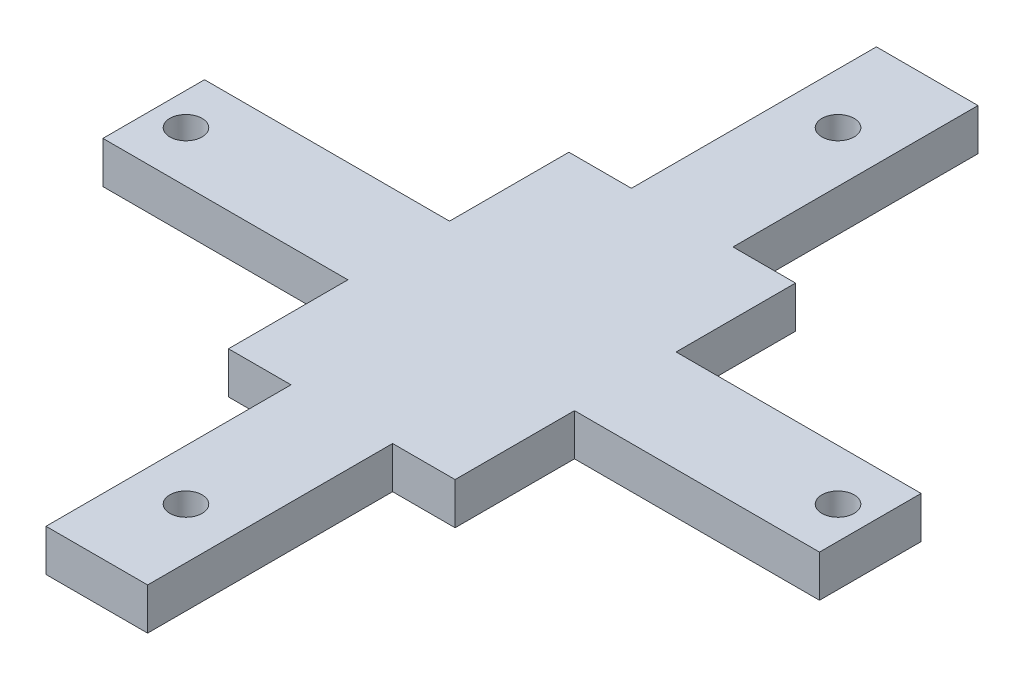
ISO-10303-21;
HEADER;
FILE_DESCRIPTION(('STEP AP214'),'2;1');
FILE_NAME('part.step','',(''),(''),'','','');
FILE_SCHEMA(('AUTOMOTIVE_DESIGN { 1 0 10303 214 1 1 1 1 }'));
ENDSEC;
DATA;
#1=APPLICATION_CONTEXT('core data for automotive mechanical design processes');
#2=APPLICATION_PROTOCOL_DEFINITION('international standard','automotive_design',2000,#1);
#3=PRODUCT_CONTEXT('',#1,'mechanical');
#4=PRODUCT('Part','Part','',(#3));
#5=PRODUCT_RELATED_PRODUCT_CATEGORY('part','',(#4));
#6=PRODUCT_DEFINITION_FORMATION('','',#4);
#7=PRODUCT_DEFINITION_CONTEXT('part definition',#1,'design');
#8=PRODUCT_DEFINITION('design','',#6,#7);
#9=PRODUCT_DEFINITION_SHAPE('','',#8);
#10=(LENGTH_UNIT() NAMED_UNIT(*) SI_UNIT(.MILLI.,.METRE.));
#11=(NAMED_UNIT(*) PLANE_ANGLE_UNIT() SI_UNIT($,.RADIAN.));
#12=(NAMED_UNIT(*) SI_UNIT($,.STERADIAN.) SOLID_ANGLE_UNIT());
#13=UNCERTAINTY_MEASURE_WITH_UNIT(LENGTH_MEASURE(1.E-05),#10,'distance_accuracy_value','');
#14=(GEOMETRIC_REPRESENTATION_CONTEXT(3) GLOBAL_UNCERTAINTY_ASSIGNED_CONTEXT((#13)) GLOBAL_UNIT_ASSIGNED_CONTEXT((#10,
#11,#12)) REPRESENTATION_CONTEXT('',''));
#15=CARTESIAN_POINT('',(0.,0.,0.));
#16=DIRECTION('',(0.,0.,1.));
#17=DIRECTION('',(1.,0.,0.));
#18=AXIS2_PLACEMENT_3D('',#15,#16,#17);
#19=CARTESIAN_POINT('',(11.15,-119.723512511459,16.75));
#20=DIRECTION('',(1.,0.,0.));
#21=DIRECTION('',(0.,1.,0.));
#22=AXIS2_PLACEMENT_3D('',#19,#20,#21);
#23=PLANE('',#22);
#24=DIRECTION('',(0.,0.,1.));
#25=VECTOR('',#24,1.);
#26=CARTESIAN_POINT('',(11.15,-123.833512511459,16.75));
#27=LINE('',#26,#25);
#28=CARTESIAN_POINT('',(11.15,-123.833512511459,5.));
#29=VERTEX_POINT('',#28);
#30=CARTESIAN_POINT('',(11.15,-123.833512511459,16.75));
#31=VERTEX_POINT('',#30);
#32=EDGE_CURVE('E202',#29,#31,#27,.T.);
#33=ORIENTED_EDGE('',*,*,#32,.F.);
#34=DIRECTION('',(0.,-1.,0.));
#35=VECTOR('',#34,1.);
#36=CARTESIAN_POINT('',(11.15,-119.723512511459,5.));
#37=LINE('',#36,#35);
#38=CARTESIAN_POINT('',(11.15,-119.723512511459,5.));
#39=VERTEX_POINT('',#38);
#40=EDGE_CURVE('E11',#39,#29,#37,.T.);
#41=ORIENTED_EDGE('',*,*,#40,.F.);
#42=DIRECTION('',(0.,0.,1.));
#43=VECTOR('',#42,1.);
#44=CARTESIAN_POINT('',(11.15,-119.723512511459,16.75));
#45=LINE('',#44,#43);
#46=CARTESIAN_POINT('',(11.15,-119.723512511459,16.75));
#47=VERTEX_POINT('',#46);
#48=EDGE_CURVE('E259',#39,#47,#45,.T.);
#49=ORIENTED_EDGE('',*,*,#48,.T.);
#50=DIRECTION('',(0.,-1.,0.));
#51=VECTOR('',#50,1.);
#52=CARTESIAN_POINT('',(11.15,-119.723512511459,16.75));
#53=LINE('',#52,#51);
#54=EDGE_CURVE('E36',#47,#31,#53,.T.);
#55=ORIENTED_EDGE('',*,*,#54,.T.);
#56=EDGE_LOOP('',(#33,#41,#49,#55));
#57=FACE_BOUND('',#56,.T.);
#58=ADVANCED_FACE('F33',(#57),#23,.T.);
#59=CARTESIAN_POINT('',(4.99999999999998,-119.723512511459,5.));
#60=DIRECTION('',(0.,0.,-1.));
#61=DIRECTION('',(-1.,0.,0.));
#62=AXIS2_PLACEMENT_3D('',#59,#60,#61);
#63=PLANE('',#62);
#64=DIRECTION('',(1.,0.,0.));
#65=VECTOR('',#64,1.);
#66=CARTESIAN_POINT('',(4.99999999999998,-123.833512511459,5.));
#67=LINE('',#66,#65);
#68=CARTESIAN_POINT('',(4.99999999999998,-123.833512511459,5.));
#69=VERTEX_POINT('',#68);
#70=EDGE_CURVE('E257',#69,#29,#67,.T.);
#71=ORIENTED_EDGE('',*,*,#70,.F.);
#72=DIRECTION('',(0.,-1.,0.));
#73=VECTOR('',#72,1.);
#74=CARTESIAN_POINT('',(4.99999999999998,-119.723512511459,5.));
#75=LINE('',#74,#73);
#76=CARTESIAN_POINT('',(4.99999999999998,-119.723512511459,5.));
#77=VERTEX_POINT('',#76);
#78=EDGE_CURVE('E42',#77,#69,#75,.T.);
#79=ORIENTED_EDGE('',*,*,#78,.F.);
#80=DIRECTION('',(1.,0.,0.));
#81=VECTOR('',#80,1.);
#82=CARTESIAN_POINT('',(4.99999999999998,-119.723512511459,5.));
#83=LINE('',#82,#81);
#84=EDGE_CURVE('E192',#77,#39,#83,.T.);
#85=ORIENTED_EDGE('',*,*,#84,.T.);
#86=ORIENTED_EDGE('',*,*,#40,.T.);
#87=EDGE_LOOP('',(#71,#79,#85,#86));
#88=FACE_BOUND('',#87,.T.);
#89=ADVANCED_FACE('F295',(#88),#63,.T.);
#90=CARTESIAN_POINT('',(4.99999999999998,-119.723512511459,-19.11));
#91=DIRECTION('',(1.,0.,0.));
#92=DIRECTION('',(0.,0.,-1.));
#93=AXIS2_PLACEMENT_3D('',#90,#91,#92);
#94=PLANE('',#93);
#95=DIRECTION('',(0.,0.,1.));
#96=VECTOR('',#95,1.);
#97=CARTESIAN_POINT('',(4.99999999999998,-123.833512511459,-19.11));
#98=LINE('',#97,#96);
#99=CARTESIAN_POINT('',(4.99999999999998,-123.833512511459,-19.11));
#100=VERTEX_POINT('',#99);
#101=EDGE_CURVE('E179',#100,#69,#98,.T.);
#102=ORIENTED_EDGE('',*,*,#101,.F.);
#103=DIRECTION('',(0.,-1.,0.));
#104=VECTOR('',#103,1.);
#105=CARTESIAN_POINT('',(4.99999999999998,-119.723512511459,-19.11));
#106=LINE('',#105,#104);
#107=CARTESIAN_POINT('',(4.99999999999998,-119.723512511459,-19.11));
#108=VERTEX_POINT('',#107);
#109=EDGE_CURVE('E174',#108,#100,#106,.T.);
#110=ORIENTED_EDGE('',*,*,#109,.F.);
#111=DIRECTION('',(0.,0.,1.));
#112=VECTOR('',#111,1.);
#113=CARTESIAN_POINT('',(4.99999999999998,-119.723512511459,-19.11));
#114=LINE('',#113,#112);
#115=EDGE_CURVE('E177',#108,#77,#114,.T.);
#116=ORIENTED_EDGE('',*,*,#115,.T.);
#117=ORIENTED_EDGE('',*,*,#78,.T.);
#118=EDGE_LOOP('',(#102,#110,#116,#117));
#119=FACE_BOUND('',#118,.T.);
#120=ADVANCED_FACE('F176',(#119),#94,.T.);
#121=CARTESIAN_POINT('',(-5.00000000000002,-119.723512511459,-19.11));
#122=DIRECTION('',(0.,0.,-1.));
#123=DIRECTION('',(-1.,0.,0.));
#124=AXIS2_PLACEMENT_3D('',#121,#122,#123);
#125=PLANE('',#124);
#126=DIRECTION('',(1.,0.,0.));
#127=VECTOR('',#126,1.);
#128=CARTESIAN_POINT('',(-5.00000000000002,-123.833512511459,-19.11));
#129=LINE('',#128,#127);
#130=CARTESIAN_POINT('',(-5.00000000000002,-123.833512511459,-19.11));
#131=VERTEX_POINT('',#130);
#132=EDGE_CURVE('E254',#131,#100,#129,.T.);
#133=ORIENTED_EDGE('',*,*,#132,.F.);
#134=DIRECTION('',(0.,-1.,0.));
#135=VECTOR('',#134,1.);
#136=CARTESIAN_POINT('',(-5.00000000000002,-119.723512511459,-19.11));
#137=LINE('',#136,#135);
#138=CARTESIAN_POINT('',(-5.00000000000002,-119.723512511459,-19.11));
#139=VERTEX_POINT('',#138);
#140=EDGE_CURVE('E184',#139,#131,#137,.T.);
#141=ORIENTED_EDGE('',*,*,#140,.F.);
#142=DIRECTION('',(1.,0.,0.));
#143=VECTOR('',#142,1.);
#144=CARTESIAN_POINT('',(-5.00000000000002,-119.723512511459,-19.11));
#145=LINE('',#144,#143);
#146=EDGE_CURVE('E190',#139,#108,#145,.T.);
#147=ORIENTED_EDGE('',*,*,#146,.T.);
#148=ORIENTED_EDGE('',*,*,#109,.T.);
#149=EDGE_LOOP('',(#133,#141,#147,#148));
#150=FACE_BOUND('',#149,.T.);
#151=ADVANCED_FACE('F194',(#150),#125,.T.);
#152=CARTESIAN_POINT('',(-5.00000000000002,-119.723512511459,5.));
#153=DIRECTION('',(-1.,0.,0.));
#154=DIRECTION('',(0.,-1.,0.));
#155=AXIS2_PLACEMENT_3D('',#152,#153,#154);
#156=PLANE('',#155);
#157=DIRECTION('',(0.,0.,-1.));
#158=VECTOR('',#157,1.);
#159=CARTESIAN_POINT('',(-5.00000000000002,-123.833512511459,5.));
#160=LINE('',#159,#158);
#161=CARTESIAN_POINT('',(-5.00000000000002,-123.833512511459,5.));
#162=VERTEX_POINT('',#161);
#163=EDGE_CURVE('E251',#162,#131,#160,.T.);
#164=ORIENTED_EDGE('',*,*,#163,.F.);
#165=DIRECTION('',(0.,-1.,0.));
#166=VECTOR('',#165,1.);
#167=CARTESIAN_POINT('',(-5.00000000000002,-119.723512511459,5.));
#168=LINE('',#167,#166);
#169=CARTESIAN_POINT('',(-5.00000000000002,-119.723512511459,5.));
#170=VERTEX_POINT('',#169);
#171=EDGE_CURVE('E263',#170,#162,#168,.T.);
#172=ORIENTED_EDGE('',*,*,#171,.F.);
#173=DIRECTION('',(0.,0.,-1.));
#174=VECTOR('',#173,1.);
#175=CARTESIAN_POINT('',(-5.00000000000002,-119.723512511459,5.));
#176=LINE('',#175,#174);
#177=EDGE_CURVE('E195',#170,#139,#176,.T.);
#178=ORIENTED_EDGE('',*,*,#177,.T.);
#179=ORIENTED_EDGE('',*,*,#140,.T.);
#180=EDGE_LOOP('',(#164,#172,#178,#179));
#181=FACE_BOUND('',#180,.T.);
#182=ADVANCED_FACE('F308',(#181),#156,.T.);
#183=CARTESIAN_POINT('',(-11.15,-119.723512511459,5.));
#184=DIRECTION('',(0.,0.,-1.));
#185=DIRECTION('',(-1.,0.,0.));
#186=AXIS2_PLACEMENT_3D('',#183,#184,#185);
#187=PLANE('',#186);
#188=DIRECTION('',(1.,0.,0.));
#189=VECTOR('',#188,1.);
#190=CARTESIAN_POINT('',(-11.15,-123.833512511459,5.));
#191=LINE('',#190,#189);
#192=CARTESIAN_POINT('',(-11.15,-123.833512511459,5.));
#193=VERTEX_POINT('',#192);
#194=EDGE_CURVE('E248',#193,#162,#191,.T.);
#195=ORIENTED_EDGE('',*,*,#194,.F.);
#196=DIRECTION('',(0.,-1.,0.));
#197=VECTOR('',#196,1.);
#198=CARTESIAN_POINT('',(-11.15,-119.723512511459,5.));
#199=LINE('',#198,#197);
#200=CARTESIAN_POINT('',(-11.15,-119.723512511459,5.));
#201=VERTEX_POINT('',#200);
#202=EDGE_CURVE('E265',#201,#193,#199,.T.);
#203=ORIENTED_EDGE('',*,*,#202,.F.);
#204=DIRECTION('',(1.,0.,0.));
#205=VECTOR('',#204,1.);
#206=CARTESIAN_POINT('',(-11.15,-119.723512511459,5.));
#207=LINE('',#206,#205);
#208=EDGE_CURVE('E197',#201,#170,#207,.T.);
#209=ORIENTED_EDGE('',*,*,#208,.T.);
#210=ORIENTED_EDGE('',*,*,#171,.T.);
#211=EDGE_LOOP('',(#195,#203,#209,#210));
#212=FACE_BOUND('',#211,.T.);
#213=ADVANCED_FACE('F311',(#212),#187,.T.);
#214=CARTESIAN_POINT('',(-11.15,-119.723512511459,16.75));
#215=DIRECTION('',(-1.,0.,0.));
#216=DIRECTION('',(0.,-1.,0.));
#217=AXIS2_PLACEMENT_3D('',#214,#215,#216);
#218=PLANE('',#217);
#219=DIRECTION('',(0.,0.,-1.));
#220=VECTOR('',#219,1.);
#221=CARTESIAN_POINT('',(-11.15,-123.833512511459,16.75));
#222=LINE('',#221,#220);
#223=CARTESIAN_POINT('',(-11.15,-123.833512511459,16.75));
#224=VERTEX_POINT('',#223);
#225=EDGE_CURVE('E245',#224,#193,#222,.T.);
#226=ORIENTED_EDGE('',*,*,#225,.F.);
#227=DIRECTION('',(0.,-1.,0.));
#228=VECTOR('',#227,1.);
#229=CARTESIAN_POINT('',(-11.15,-119.723512511459,16.75));
#230=LINE('',#229,#228);
#231=CARTESIAN_POINT('',(-11.15,-119.723512511459,16.75));
#232=VERTEX_POINT('',#231);
#233=EDGE_CURVE('E267',#232,#224,#230,.T.);
#234=ORIENTED_EDGE('',*,*,#233,.F.);
#235=DIRECTION('',(0.,0.,-1.));
#236=VECTOR('',#235,1.);
#237=CARTESIAN_POINT('',(-11.15,-119.723512511459,16.75));
#238=LINE('',#237,#236);
#239=EDGE_CURVE('E461',#232,#201,#238,.T.);
#240=ORIENTED_EDGE('',*,*,#239,.T.);
#241=ORIENTED_EDGE('',*,*,#202,.T.);
#242=EDGE_LOOP('',(#226,#234,#240,#241));
#243=FACE_BOUND('',#242,.T.);
#244=ADVANCED_FACE('F315',(#243),#218,.T.);
#245=CARTESIAN_POINT('',(-35.26,-119.723512511459,16.75));
#246=DIRECTION('',(0.,0.,-1.));
#247=DIRECTION('',(-1.,0.,0.));
#248=AXIS2_PLACEMENT_3D('',#245,#246,#247);
#249=PLANE('',#248);
#250=DIRECTION('',(1.,0.,0.));
#251=VECTOR('',#250,1.);
#252=CARTESIAN_POINT('',(-35.26,-123.833512511459,16.75));
#253=LINE('',#252,#251);
#254=CARTESIAN_POINT('',(-35.26,-123.833512511459,16.75));
#255=VERTEX_POINT('',#254);
#256=EDGE_CURVE('E242',#255,#224,#253,.T.);
#257=ORIENTED_EDGE('',*,*,#256,.F.);
#258=DIRECTION('',(0.,-1.,0.));
#259=VECTOR('',#258,1.);
#260=CARTESIAN_POINT('',(-35.26,-119.723512511459,16.75));
#261=LINE('',#260,#259);
#262=CARTESIAN_POINT('',(-35.26,-119.723512511459,16.75));
#263=VERTEX_POINT('',#262);
#264=EDGE_CURVE('E269',#263,#255,#261,.T.);
#265=ORIENTED_EDGE('',*,*,#264,.F.);
#266=DIRECTION('',(1.,0.,0.));
#267=VECTOR('',#266,1.);
#268=CARTESIAN_POINT('',(-35.26,-119.723512511459,16.75));
#269=LINE('',#268,#267);
#270=EDGE_CURVE('E458',#263,#232,#269,.T.);
#271=ORIENTED_EDGE('',*,*,#270,.T.);
#272=ORIENTED_EDGE('',*,*,#233,.T.);
#273=EDGE_LOOP('',(#257,#265,#271,#272));
#274=FACE_BOUND('',#273,.T.);
#275=ADVANCED_FACE('F319',(#274),#249,.T.);
#276=CARTESIAN_POINT('',(-35.26,-119.723512511459,26.75));
#277=DIRECTION('',(-1.,0.,0.));
#278=DIRECTION('',(0.,0.,1.));
#279=AXIS2_PLACEMENT_3D('',#276,#277,#278);
#280=PLANE('',#279);
#281=DIRECTION('',(0.,0.,-1.));
#282=VECTOR('',#281,1.);
#283=CARTESIAN_POINT('',(-35.26,-123.833512511459,26.75));
#284=LINE('',#283,#282);
#285=CARTESIAN_POINT('',(-35.26,-123.833512511459,26.75));
#286=VERTEX_POINT('',#285);
#287=EDGE_CURVE('E239',#286,#255,#284,.T.);
#288=ORIENTED_EDGE('',*,*,#287,.F.);
#289=DIRECTION('',(0.,-1.,0.));
#290=VECTOR('',#289,1.);
#291=CARTESIAN_POINT('',(-35.26,-119.723512511459,26.75));
#292=LINE('',#291,#290);
#293=CARTESIAN_POINT('',(-35.26,-119.723512511459,26.75));
#294=VERTEX_POINT('',#293);
#295=EDGE_CURVE('E271',#294,#286,#292,.T.);
#296=ORIENTED_EDGE('',*,*,#295,.F.);
#297=DIRECTION('',(0.,0.,-1.));
#298=VECTOR('',#297,1.);
#299=CARTESIAN_POINT('',(-35.26,-119.723512511459,26.75));
#300=LINE('',#299,#298);
#301=EDGE_CURVE('E455',#294,#263,#300,.T.);
#302=ORIENTED_EDGE('',*,*,#301,.T.);
#303=ORIENTED_EDGE('',*,*,#264,.T.);
#304=EDGE_LOOP('',(#288,#296,#302,#303));
#305=FACE_BOUND('',#304,.T.);
#306=ADVANCED_FACE('F323',(#305),#280,.T.);
#307=CARTESIAN_POINT('',(-11.15,-119.723512511459,26.75));
#308=DIRECTION('',(0.,0.,1.));
#309=DIRECTION('',(1.,0.,0.));
#310=AXIS2_PLACEMENT_3D('',#307,#308,#309);
#311=PLANE('',#310);
#312=DIRECTION('',(-1.,0.,0.));
#313=VECTOR('',#312,1.);
#314=CARTESIAN_POINT('',(-11.15,-123.833512511459,26.75));
#315=LINE('',#314,#313);
#316=CARTESIAN_POINT('',(-11.15,-123.833512511459,26.75));
#317=VERTEX_POINT('',#316);
#318=EDGE_CURVE('E236',#317,#286,#315,.T.);
#319=ORIENTED_EDGE('',*,*,#318,.F.);
#320=DIRECTION('',(0.,-1.,0.));
#321=VECTOR('',#320,1.);
#322=CARTESIAN_POINT('',(-11.15,-119.723512511459,26.75));
#323=LINE('',#322,#321);
#324=CARTESIAN_POINT('',(-11.15,-119.723512511459,26.75));
#325=VERTEX_POINT('',#324);
#326=EDGE_CURVE('E273',#325,#317,#323,.T.);
#327=ORIENTED_EDGE('',*,*,#326,.F.);
#328=DIRECTION('',(-1.,0.,0.));
#329=VECTOR('',#328,1.);
#330=CARTESIAN_POINT('',(-11.15,-119.723512511459,26.75));
#331=LINE('',#330,#329);
#332=EDGE_CURVE('E452',#325,#294,#331,.T.);
#333=ORIENTED_EDGE('',*,*,#332,.T.);
#334=ORIENTED_EDGE('',*,*,#295,.T.);
#335=EDGE_LOOP('',(#319,#327,#333,#334));
#336=FACE_BOUND('',#335,.T.);
#337=ADVANCED_FACE('F327',(#336),#311,.T.);
#338=CARTESIAN_POINT('',(-11.15,-119.723512511459,26.75));
#339=DIRECTION('',(-1.,0.,0.));
#340=DIRECTION('',(0.,0.,1.));
#341=AXIS2_PLACEMENT_3D('',#338,#339,#340);
#342=PLANE('',#341);
#343=DIRECTION('',(0.,0.,-1.));
#344=VECTOR('',#343,1.);
#345=CARTESIAN_POINT('',(-11.15,-123.833512511459,26.75));
#346=LINE('',#345,#344);
#347=CARTESIAN_POINT('',(-11.15,-123.833512511459,38.5));
#348=VERTEX_POINT('',#347);
#349=EDGE_CURVE('E233',#348,#317,#346,.T.);
#350=ORIENTED_EDGE('',*,*,#349,.F.);
#351=DIRECTION('',(0.,-1.,0.));
#352=VECTOR('',#351,1.);
#353=CARTESIAN_POINT('',(-11.15,-119.723512511459,38.5));
#354=LINE('',#353,#352);
#355=CARTESIAN_POINT('',(-11.15,-119.723512511459,38.5));
#356=VERTEX_POINT('',#355);
#357=EDGE_CURVE('E275',#356,#348,#354,.T.);
#358=ORIENTED_EDGE('',*,*,#357,.F.);
#359=DIRECTION('',(0.,0.,-1.));
#360=VECTOR('',#359,1.);
#361=CARTESIAN_POINT('',(-11.15,-119.723512511459,26.75));
#362=LINE('',#361,#360);
#363=EDGE_CURVE('E449',#356,#325,#362,.T.);
#364=ORIENTED_EDGE('',*,*,#363,.T.);
#365=ORIENTED_EDGE('',*,*,#326,.T.);
#366=EDGE_LOOP('',(#350,#358,#364,#365));
#367=FACE_BOUND('',#366,.T.);
#368=ADVANCED_FACE('F331',(#367),#342,.T.);
#369=CARTESIAN_POINT('',(-5.00000000000001,-119.723512511459,38.5));
#370=DIRECTION('',(0.,0.,1.));
#371=DIRECTION('',(1.,0.,0.));
#372=AXIS2_PLACEMENT_3D('',#369,#370,#371);
#373=PLANE('',#372);
#374=DIRECTION('',(-1.,0.,0.));
#375=VECTOR('',#374,1.);
#376=CARTESIAN_POINT('',(-5.00000000000002,-123.833512511459,38.5));
#377=LINE('',#376,#375);
#378=CARTESIAN_POINT('',(-5.00000000000002,-123.833512511459,38.5));
#379=VERTEX_POINT('',#378);
#380=EDGE_CURVE('E230',#379,#348,#377,.T.);
#381=ORIENTED_EDGE('',*,*,#380,.F.);
#382=DIRECTION('',(0.,-1.,0.));
#383=VECTOR('',#382,1.);
#384=CARTESIAN_POINT('',(-5.00000000000001,-119.723512511459,38.5));
#385=LINE('',#384,#383);
#386=CARTESIAN_POINT('',(-5.00000000000001,-119.723512511459,38.5));
#387=VERTEX_POINT('',#386);
#388=EDGE_CURVE('E277',#387,#379,#385,.T.);
#389=ORIENTED_EDGE('',*,*,#388,.F.);
#390=DIRECTION('',(-1.,0.,0.));
#391=VECTOR('',#390,1.);
#392=CARTESIAN_POINT('',(-5.00000000000001,-119.723512511459,38.5));
#393=LINE('',#392,#391);
#394=EDGE_CURVE('E446',#387,#356,#393,.T.);
#395=ORIENTED_EDGE('',*,*,#394,.T.);
#396=ORIENTED_EDGE('',*,*,#357,.T.);
#397=EDGE_LOOP('',(#381,#389,#395,#396));
#398=FACE_BOUND('',#397,.T.);
#399=ADVANCED_FACE('F335',(#398),#373,.T.);
#400=CARTESIAN_POINT('',(-5.00000000000001,-119.723512511459,62.61));
#401=DIRECTION('',(-1.,0.,0.));
#402=DIRECTION('',(0.,-1.,0.));
#403=AXIS2_PLACEMENT_3D('',#400,#401,#402);
#404=PLANE('',#403);
#405=DIRECTION('',(0.,0.,-1.));
#406=VECTOR('',#405,1.);
#407=CARTESIAN_POINT('',(-5.00000000000002,-123.833512511459,62.61));
#408=LINE('',#407,#406);
#409=CARTESIAN_POINT('',(-5.00000000000002,-123.833512511459,62.61));
#410=VERTEX_POINT('',#409);
#411=EDGE_CURVE('E227',#410,#379,#408,.T.);
#412=ORIENTED_EDGE('',*,*,#411,.F.);
#413=DIRECTION('',(0.,-1.,0.));
#414=VECTOR('',#413,1.);
#415=CARTESIAN_POINT('',(-5.00000000000001,-119.723512511459,62.61));
#416=LINE('',#415,#414);
#417=CARTESIAN_POINT('',(-5.00000000000001,-119.723512511459,62.61));
#418=VERTEX_POINT('',#417);
#419=EDGE_CURVE('E279',#418,#410,#416,.T.);
#420=ORIENTED_EDGE('',*,*,#419,.F.);
#421=DIRECTION('',(0.,0.,-1.));
#422=VECTOR('',#421,1.);
#423=CARTESIAN_POINT('',(-5.00000000000001,-119.723512511459,62.61));
#424=LINE('',#423,#422);
#425=EDGE_CURVE('E443',#418,#387,#424,.T.);
#426=ORIENTED_EDGE('',*,*,#425,.T.);
#427=ORIENTED_EDGE('',*,*,#388,.T.);
#428=EDGE_LOOP('',(#412,#420,#426,#427));
#429=FACE_BOUND('',#428,.T.);
#430=ADVANCED_FACE('F339',(#429),#404,.T.);
#431=CARTESIAN_POINT('',(4.99999999999998,-119.723512511459,62.61));
#432=DIRECTION('',(0.,0.,1.));
#433=DIRECTION('',(1.,0.,0.));
#434=AXIS2_PLACEMENT_3D('',#431,#432,#433);
#435=PLANE('',#434);
#436=DIRECTION('',(-1.,0.,0.));
#437=VECTOR('',#436,1.);
#438=CARTESIAN_POINT('',(4.99999999999998,-123.833512511459,62.61));
#439=LINE('',#438,#437);
#440=CARTESIAN_POINT('',(4.99999999999998,-123.833512511459,62.61));
#441=VERTEX_POINT('',#440);
#442=EDGE_CURVE('E224',#441,#410,#439,.T.);
#443=ORIENTED_EDGE('',*,*,#442,.F.);
#444=DIRECTION('',(0.,-1.,0.));
#445=VECTOR('',#444,1.);
#446=CARTESIAN_POINT('',(4.99999999999998,-119.723512511459,62.61));
#447=LINE('',#446,#445);
#448=CARTESIAN_POINT('',(4.99999999999998,-119.723512511459,62.61));
#449=VERTEX_POINT('',#448);
#450=EDGE_CURVE('E281',#449,#441,#447,.T.);
#451=ORIENTED_EDGE('',*,*,#450,.F.);
#452=DIRECTION('',(-1.,0.,0.));
#453=VECTOR('',#452,1.);
#454=CARTESIAN_POINT('',(4.99999999999998,-119.723512511459,62.61));
#455=LINE('',#454,#453);
#456=EDGE_CURVE('E440',#449,#418,#455,.T.);
#457=ORIENTED_EDGE('',*,*,#456,.T.);
#458=ORIENTED_EDGE('',*,*,#419,.T.);
#459=EDGE_LOOP('',(#443,#451,#457,#458));
#460=FACE_BOUND('',#459,.T.);
#461=ADVANCED_FACE('F343',(#460),#435,.T.);
#462=CARTESIAN_POINT('',(4.99999999999999,-119.723512511459,38.5));
#463=DIRECTION('',(1.,0.,0.));
#464=DIRECTION('',(0.,0.,-1.));
#465=AXIS2_PLACEMENT_3D('',#462,#463,#464);
#466=PLANE('',#465);
#467=DIRECTION('',(0.,0.,1.));
#468=VECTOR('',#467,1.);
#469=CARTESIAN_POINT('',(4.99999999999999,-123.833512511459,38.5));
#470=LINE('',#469,#468);
#471=CARTESIAN_POINT('',(4.99999999999999,-123.833512511459,38.5));
#472=VERTEX_POINT('',#471);
#473=EDGE_CURVE('E221',#472,#441,#470,.T.);
#474=ORIENTED_EDGE('',*,*,#473,.F.);
#475=DIRECTION('',(0.,-1.,0.));
#476=VECTOR('',#475,1.);
#477=CARTESIAN_POINT('',(4.99999999999999,-119.723512511459,38.5));
#478=LINE('',#477,#476);
#479=CARTESIAN_POINT('',(4.99999999999999,-119.723512511459,38.5));
#480=VERTEX_POINT('',#479);
#481=EDGE_CURVE('E283',#480,#472,#478,.T.);
#482=ORIENTED_EDGE('',*,*,#481,.F.);
#483=DIRECTION('',(0.,0.,1.));
#484=VECTOR('',#483,1.);
#485=CARTESIAN_POINT('',(4.99999999999999,-119.723512511459,38.5));
#486=LINE('',#485,#484);
#487=EDGE_CURVE('E437',#480,#449,#486,.T.);
#488=ORIENTED_EDGE('',*,*,#487,.T.);
#489=ORIENTED_EDGE('',*,*,#450,.T.);
#490=EDGE_LOOP('',(#474,#482,#488,#489));
#491=FACE_BOUND('',#490,.T.);
#492=ADVANCED_FACE('F347',(#491),#466,.T.);
#493=CARTESIAN_POINT('',(11.15,-119.723512511459,38.5));
#494=DIRECTION('',(0.,0.,1.));
#495=DIRECTION('',(1.,0.,0.));
#496=AXIS2_PLACEMENT_3D('',#493,#494,#495);
#497=PLANE('',#496);
#498=DIRECTION('',(-1.,0.,0.));
#499=VECTOR('',#498,1.);
#500=CARTESIAN_POINT('',(11.15,-123.833512511459,38.5));
#501=LINE('',#500,#499);
#502=CARTESIAN_POINT('',(11.15,-123.833512511459,38.5));
#503=VERTEX_POINT('',#502);
#504=EDGE_CURVE('E218',#503,#472,#501,.T.);
#505=ORIENTED_EDGE('',*,*,#504,.F.);
#506=DIRECTION('',(0.,-1.,0.));
#507=VECTOR('',#506,1.);
#508=CARTESIAN_POINT('',(11.15,-119.723512511459,38.5));
#509=LINE('',#508,#507);
#510=CARTESIAN_POINT('',(11.15,-119.723512511459,38.5));
#511=VERTEX_POINT('',#510);
#512=EDGE_CURVE('E285',#511,#503,#509,.T.);
#513=ORIENTED_EDGE('',*,*,#512,.F.);
#514=DIRECTION('',(-1.,0.,0.));
#515=VECTOR('',#514,1.);
#516=CARTESIAN_POINT('',(11.15,-119.723512511459,38.5));
#517=LINE('',#516,#515);
#518=EDGE_CURVE('E434',#511,#480,#517,.T.);
#519=ORIENTED_EDGE('',*,*,#518,.T.);
#520=ORIENTED_EDGE('',*,*,#481,.T.);
#521=EDGE_LOOP('',(#505,#513,#519,#520));
#522=FACE_BOUND('',#521,.T.);
#523=ADVANCED_FACE('F351',(#522),#497,.T.);
#524=CARTESIAN_POINT('',(11.15,-119.723512511459,26.75));
#525=DIRECTION('',(1.,0.,0.));
#526=DIRECTION('',(0.,1.,0.));
#527=AXIS2_PLACEMENT_3D('',#524,#525,#526);
#528=PLANE('',#527);
#529=DIRECTION('',(0.,0.,1.));
#530=VECTOR('',#529,1.);
#531=CARTESIAN_POINT('',(11.15,-123.833512511459,26.75));
#532=LINE('',#531,#530);
#533=CARTESIAN_POINT('',(11.15,-123.833512511459,26.75));
#534=VERTEX_POINT('',#533);
#535=EDGE_CURVE('E215',#534,#503,#532,.T.);
#536=ORIENTED_EDGE('',*,*,#535,.F.);
#537=DIRECTION('',(0.,-1.,0.));
#538=VECTOR('',#537,1.);
#539=CARTESIAN_POINT('',(11.15,-119.723512511459,26.75));
#540=LINE('',#539,#538);
#541=CARTESIAN_POINT('',(11.15,-119.723512511459,26.75));
#542=VERTEX_POINT('',#541);
#543=EDGE_CURVE('E287',#542,#534,#540,.T.);
#544=ORIENTED_EDGE('',*,*,#543,.F.);
#545=DIRECTION('',(0.,0.,1.));
#546=VECTOR('',#545,1.);
#547=CARTESIAN_POINT('',(11.15,-119.723512511459,26.75));
#548=LINE('',#547,#546);
#549=EDGE_CURVE('E431',#542,#511,#548,.T.);
#550=ORIENTED_EDGE('',*,*,#549,.T.);
#551=ORIENTED_EDGE('',*,*,#512,.T.);
#552=EDGE_LOOP('',(#536,#544,#550,#551));
#553=FACE_BOUND('',#552,.T.);
#554=ADVANCED_FACE('F355',(#553),#528,.T.);
#555=CARTESIAN_POINT('',(35.26,-119.723512511459,26.75));
#556=DIRECTION('',(0.,0.,1.));
#557=DIRECTION('',(1.,0.,0.));
#558=AXIS2_PLACEMENT_3D('',#555,#556,#557);
#559=PLANE('',#558);
#560=DIRECTION('',(-1.,0.,0.));
#561=VECTOR('',#560,1.);
#562=CARTESIAN_POINT('',(35.26,-123.833512511459,26.75));
#563=LINE('',#562,#561);
#564=CARTESIAN_POINT('',(35.26,-123.833512511459,26.75));
#565=VERTEX_POINT('',#564);
#566=EDGE_CURVE('E212',#565,#534,#563,.T.);
#567=ORIENTED_EDGE('',*,*,#566,.F.);
#568=DIRECTION('',(0.,-1.,0.));
#569=VECTOR('',#568,1.);
#570=CARTESIAN_POINT('',(35.26,-119.723512511459,26.75));
#571=LINE('',#570,#569);
#572=CARTESIAN_POINT('',(35.26,-119.723512511459,26.75));
#573=VERTEX_POINT('',#572);
#574=EDGE_CURVE('E289',#573,#565,#571,.T.);
#575=ORIENTED_EDGE('',*,*,#574,.F.);
#576=DIRECTION('',(-1.,0.,0.));
#577=VECTOR('',#576,1.);
#578=CARTESIAN_POINT('',(35.26,-119.723512511459,26.75));
#579=LINE('',#578,#577);
#580=EDGE_CURVE('E428',#573,#542,#579,.T.);
#581=ORIENTED_EDGE('',*,*,#580,.T.);
#582=ORIENTED_EDGE('',*,*,#543,.T.);
#583=EDGE_LOOP('',(#567,#575,#581,#582));
#584=FACE_BOUND('',#583,.T.);
#585=ADVANCED_FACE('F359',(#584),#559,.T.);
#586=CARTESIAN_POINT('',(35.26,-119.723512511459,16.75));
#587=DIRECTION('',(1.,0.,0.));
#588=DIRECTION('',(0.,1.,0.));
#589=AXIS2_PLACEMENT_3D('',#586,#587,#588);
#590=PLANE('',#589);
#591=DIRECTION('',(0.,0.,1.));
#592=VECTOR('',#591,1.);
#593=CARTESIAN_POINT('',(35.26,-123.833512511459,16.75));
#594=LINE('',#593,#592);
#595=CARTESIAN_POINT('',(35.26,-123.833512511459,16.75));
#596=VERTEX_POINT('',#595);
#597=EDGE_CURVE('E209',#596,#565,#594,.T.);
#598=ORIENTED_EDGE('',*,*,#597,.F.);
#599=DIRECTION('',(0.,-1.,0.));
#600=VECTOR('',#599,1.);
#601=CARTESIAN_POINT('',(35.26,-119.723512511459,16.75));
#602=LINE('',#601,#600);
#603=CARTESIAN_POINT('',(35.26,-119.723512511459,16.75));
#604=VERTEX_POINT('',#603);
#605=EDGE_CURVE('E290',#604,#596,#602,.T.);
#606=ORIENTED_EDGE('',*,*,#605,.F.);
#607=DIRECTION('',(0.,0.,1.));
#608=VECTOR('',#607,1.);
#609=CARTESIAN_POINT('',(35.26,-119.723512511459,16.75));
#610=LINE('',#609,#608);
#611=EDGE_CURVE('E425',#604,#573,#610,.T.);
#612=ORIENTED_EDGE('',*,*,#611,.T.);
#613=ORIENTED_EDGE('',*,*,#574,.T.);
#614=EDGE_LOOP('',(#598,#606,#612,#613));
#615=FACE_BOUND('',#614,.T.);
#616=ADVANCED_FACE('F363',(#615),#590,.T.);
#617=CARTESIAN_POINT('',(11.15,-119.723512511459,16.75));
#618=DIRECTION('',(0.,0.,-1.));
#619=DIRECTION('',(-1.,0.,0.));
#620=AXIS2_PLACEMENT_3D('',#617,#618,#619);
#621=PLANE('',#620);
#622=DIRECTION('',(1.,0.,0.));
#623=VECTOR('',#622,1.);
#624=CARTESIAN_POINT('',(11.15,-123.833512511459,16.75));
#625=LINE('',#624,#623);
#626=EDGE_CURVE('E205',#31,#596,#625,.T.);
#627=ORIENTED_EDGE('',*,*,#626,.F.);
#628=ORIENTED_EDGE('',*,*,#54,.F.);
#629=DIRECTION('',(1.,0.,0.));
#630=VECTOR('',#629,1.);
#631=CARTESIAN_POINT('',(11.15,-119.723512511459,16.75));
#632=LINE('',#631,#630);
#633=EDGE_CURVE('E423',#47,#604,#632,.T.);
#634=ORIENTED_EDGE('',*,*,#633,.T.);
#635=ORIENTED_EDGE('',*,*,#605,.T.);
#636=EDGE_LOOP('',(#627,#628,#634,#635));
#637=FACE_BOUND('',#636,.T.);
#638=ADVANCED_FACE('F292',(#637),#621,.T.);
#639=CARTESIAN_POINT('',(0.,-119.723512511459,0.));
#640=DIRECTION('',(0.,-1.,0.));
#641=DIRECTION('',(0.,0.,-1.));
#642=AXIS2_PLACEMENT_3D('',#639,#640,#641);
#643=PLANE('',#642);
#644=CARTESIAN_POINT('',(0.,-119.723512511459,53.835));
#645=DIRECTION('',(0.,-1.,0.));
#646=DIRECTION('',(0.,0.,-1.));
#647=AXIS2_PLACEMENT_3D('',#644,#645,#646);
#648=CIRCLE('',#647,1.5875);
#649=CARTESIAN_POINT('',(0.,-119.723512511459,52.2475));
#650=VERTEX_POINT('',#649);
#651=EDGE_CURVE('E401',#650,#650,#648,.F.);
#652=ORIENTED_EDGE('',*,*,#651,.F.);
#653=EDGE_LOOP('',(#652));
#654=FACE_BOUND('',#653,.T.);
#655=CARTESIAN_POINT('',(32.085,-119.723512511459,21.75));
#656=DIRECTION('',(0.,-1.,0.));
#657=DIRECTION('',(0.,0.,-1.));
#658=AXIS2_PLACEMENT_3D('',#655,#656,#657);
#659=CIRCLE('',#658,1.58750000000001);
#660=CARTESIAN_POINT('',(32.085,-119.723512511459,20.1625));
#661=VERTEX_POINT('',#660);
#662=EDGE_CURVE('E406',#661,#661,#659,.F.);
#663=ORIENTED_EDGE('',*,*,#662,.F.);
#664=EDGE_LOOP('',(#663));
#665=FACE_BOUND('',#664,.T.);
#666=CARTESIAN_POINT('',(0.,-119.723512511459,-10.335));
#667=DIRECTION('',(0.,-1.,0.));
#668=DIRECTION('',(0.,0.,-1.));
#669=AXIS2_PLACEMENT_3D('',#666,#667,#668);
#670=CIRCLE('',#669,1.5875);
#671=CARTESIAN_POINT('',(0.,-119.723512511459,-11.9225));
#672=VERTEX_POINT('',#671);
#673=EDGE_CURVE('E412',#672,#672,#670,.F.);
#674=ORIENTED_EDGE('',*,*,#673,.F.);
#675=EDGE_LOOP('',(#674));
#676=FACE_BOUND('',#675,.T.);
#677=CARTESIAN_POINT('',(-32.085,-119.723512511459,21.75));
#678=DIRECTION('',(0.,-1.,0.));
#679=DIRECTION('',(0.,0.,-1.));
#680=AXIS2_PLACEMENT_3D('',#677,#678,#679);
#681=CIRCLE('',#680,1.5875);
#682=CARTESIAN_POINT('',(-32.085,-119.723512511459,20.1625));
#683=VERTEX_POINT('',#682);
#684=EDGE_CURVE('E206',#683,#683,#681,.F.);
#685=ORIENTED_EDGE('',*,*,#684,.F.);
#686=EDGE_LOOP('',(#685));
#687=FACE_BOUND('',#686,.T.);
#688=ORIENTED_EDGE('',*,*,#48,.F.);
#689=ORIENTED_EDGE('',*,*,#84,.F.);
#690=ORIENTED_EDGE('',*,*,#115,.F.);
#691=ORIENTED_EDGE('',*,*,#146,.F.);
#692=ORIENTED_EDGE('',*,*,#177,.F.);
#693=ORIENTED_EDGE('',*,*,#208,.F.);
#694=ORIENTED_EDGE('',*,*,#239,.F.);
#695=ORIENTED_EDGE('',*,*,#270,.F.);
#696=ORIENTED_EDGE('',*,*,#301,.F.);
#697=ORIENTED_EDGE('',*,*,#332,.F.);
#698=ORIENTED_EDGE('',*,*,#363,.F.);
#699=ORIENTED_EDGE('',*,*,#394,.F.);
#700=ORIENTED_EDGE('',*,*,#425,.F.);
#701=ORIENTED_EDGE('',*,*,#456,.F.);
#702=ORIENTED_EDGE('',*,*,#487,.F.);
#703=ORIENTED_EDGE('',*,*,#518,.F.);
#704=ORIENTED_EDGE('',*,*,#549,.F.);
#705=ORIENTED_EDGE('',*,*,#580,.F.);
#706=ORIENTED_EDGE('',*,*,#611,.F.);
#707=ORIENTED_EDGE('',*,*,#633,.F.);
#708=EDGE_LOOP('',(#688,#689,#690,#691,#692,#693,#694,#695,#696,#697,#698,#699,#700,#701,#702,
#703,#704,#705,#706,#707));
#709=FACE_BOUND('',#708,.T.);
#710=ADVANCED_FACE('F188',(#654,#665,#676,#687,#709),#643,.F.);
#711=CARTESIAN_POINT('',(0.,-123.833512511459,0.));
#712=DIRECTION('',(0.,-1.,0.));
#713=DIRECTION('',(0.,0.,-1.));
#714=AXIS2_PLACEMENT_3D('',#711,#712,#713);
#715=PLANE('',#714);
#716=CARTESIAN_POINT('',(0.,-123.833512511459,53.835));
#717=DIRECTION('',(0.,-1.,0.));
#718=DIRECTION('',(0.,0.,-1.));
#719=AXIS2_PLACEMENT_3D('',#716,#717,#718);
#720=CIRCLE('',#719,1.5875);
#721=CARTESIAN_POINT('',(0.,-123.833512511459,52.2475));
#722=VERTEX_POINT('',#721);
#723=EDGE_CURVE('E399',#722,#722,#720,.T.);
#724=ORIENTED_EDGE('',*,*,#723,.F.);
#725=EDGE_LOOP('',(#724));
#726=FACE_BOUND('',#725,.T.);
#727=CARTESIAN_POINT('',(32.085,-123.833512511459,21.75));
#728=DIRECTION('',(0.,-1.,0.));
#729=DIRECTION('',(0.,0.,-1.));
#730=AXIS2_PLACEMENT_3D('',#727,#728,#729);
#731=CIRCLE('',#730,1.58750000000001);
#732=CARTESIAN_POINT('',(32.085,-123.833512511459,20.1625));
#733=VERTEX_POINT('',#732);
#734=EDGE_CURVE('E409',#733,#733,#731,.T.);
#735=ORIENTED_EDGE('',*,*,#734,.F.);
#736=EDGE_LOOP('',(#735));
#737=FACE_BOUND('',#736,.T.);
#738=CARTESIAN_POINT('',(0.,-123.833512511459,-10.335));
#739=DIRECTION('',(0.,-1.,0.));
#740=DIRECTION('',(0.,0.,-1.));
#741=AXIS2_PLACEMENT_3D('',#738,#739,#740);
#742=CIRCLE('',#741,1.5875);
#743=CARTESIAN_POINT('',(0.,-123.833512511459,-11.9225));
#744=VERTEX_POINT('',#743);
#745=EDGE_CURVE('E415',#744,#744,#742,.T.);
#746=ORIENTED_EDGE('',*,*,#745,.F.);
#747=EDGE_LOOP('',(#746));
#748=FACE_BOUND('',#747,.T.);
#749=CARTESIAN_POINT('',(-32.085,-123.833512511459,21.75));
#750=DIRECTION('',(0.,-1.,0.));
#751=DIRECTION('',(0.,0.,-1.));
#752=AXIS2_PLACEMENT_3D('',#749,#750,#751);
#753=CIRCLE('',#752,1.5875);
#754=CARTESIAN_POINT('',(-32.085,-123.833512511459,20.1625));
#755=VERTEX_POINT('',#754);
#756=EDGE_CURVE('E402',#755,#755,#753,.T.);
#757=ORIENTED_EDGE('',*,*,#756,.F.);
#758=EDGE_LOOP('',(#757));
#759=FACE_BOUND('',#758,.T.);
#760=ORIENTED_EDGE('',*,*,#32,.T.);
#761=ORIENTED_EDGE('',*,*,#626,.T.);
#762=ORIENTED_EDGE('',*,*,#597,.T.);
#763=ORIENTED_EDGE('',*,*,#566,.T.);
#764=ORIENTED_EDGE('',*,*,#535,.T.);
#765=ORIENTED_EDGE('',*,*,#504,.T.);
#766=ORIENTED_EDGE('',*,*,#473,.T.);
#767=ORIENTED_EDGE('',*,*,#442,.T.);
#768=ORIENTED_EDGE('',*,*,#411,.T.);
#769=ORIENTED_EDGE('',*,*,#380,.T.);
#770=ORIENTED_EDGE('',*,*,#349,.T.);
#771=ORIENTED_EDGE('',*,*,#318,.T.);
#772=ORIENTED_EDGE('',*,*,#287,.T.);
#773=ORIENTED_EDGE('',*,*,#256,.T.);
#774=ORIENTED_EDGE('',*,*,#225,.T.);
#775=ORIENTED_EDGE('',*,*,#194,.T.);
#776=ORIENTED_EDGE('',*,*,#163,.T.);
#777=ORIENTED_EDGE('',*,*,#132,.T.);
#778=ORIENTED_EDGE('',*,*,#101,.T.);
#779=ORIENTED_EDGE('',*,*,#70,.T.);
#780=EDGE_LOOP('',(#760,#761,#762,#763,#764,#765,#766,#767,#768,#769,#770,#771,#772,#773,#774,
#775,#776,#777,#778,#779));
#781=FACE_BOUND('',#780,.T.);
#782=ADVANCED_FACE('F294',(#726,#737,#748,#759,#781),#715,.T.);
#783=CARTESIAN_POINT('',(-32.085,-119.722512511459,21.75));
#784=DIRECTION('',(0.,-1.,0.));
#785=DIRECTION('',(0.,0.,-1.));
#786=AXIS2_PLACEMENT_3D('',#783,#784,#785);
#787=CYLINDRICAL_SURFACE('',#786,1.5875);
#788=ORIENTED_EDGE('',*,*,#756,.T.);
#789=EDGE_LOOP('',(#788));
#790=FACE_BOUND('',#789,.T.);
#791=ORIENTED_EDGE('',*,*,#684,.T.);
#792=EDGE_LOOP('',(#791));
#793=FACE_BOUND('',#792,.T.);
#794=ADVANCED_FACE('F375',(#790,#793),#787,.F.);
#795=CARTESIAN_POINT('',(0.,-119.722512511459,-10.335));
#796=DIRECTION('',(0.,-1.,0.));
#797=DIRECTION('',(0.,0.,-1.));
#798=AXIS2_PLACEMENT_3D('',#795,#796,#797);
#799=CYLINDRICAL_SURFACE('',#798,1.5875);
#800=ORIENTED_EDGE('',*,*,#745,.T.);
#801=EDGE_LOOP('',(#800));
#802=FACE_BOUND('',#801,.T.);
#803=ORIENTED_EDGE('',*,*,#673,.T.);
#804=EDGE_LOOP('',(#803));
#805=FACE_BOUND('',#804,.T.);
#806=ADVANCED_FACE('F382',(#802,#805),#799,.F.);
#807=CARTESIAN_POINT('',(32.085,-119.722512511459,21.75));
#808=DIRECTION('',(0.,-1.,0.));
#809=DIRECTION('',(0.,0.,-1.));
#810=AXIS2_PLACEMENT_3D('',#807,#808,#809);
#811=CYLINDRICAL_SURFACE('',#810,1.58750000000001);
#812=ORIENTED_EDGE('',*,*,#734,.T.);
#813=EDGE_LOOP('',(#812));
#814=FACE_BOUND('',#813,.T.);
#815=ORIENTED_EDGE('',*,*,#662,.T.);
#816=EDGE_LOOP('',(#815));
#817=FACE_BOUND('',#816,.T.);
#818=ADVANCED_FACE('F386',(#814,#817),#811,.F.);
#819=CARTESIAN_POINT('',(0.,-119.722512511459,53.835));
#820=DIRECTION('',(0.,-1.,0.));
#821=DIRECTION('',(0.,0.,-1.));
#822=AXIS2_PLACEMENT_3D('',#819,#820,#821);
#823=CYLINDRICAL_SURFACE('',#822,1.5875);
#824=ORIENTED_EDGE('',*,*,#723,.T.);
#825=EDGE_LOOP('',(#824));
#826=FACE_BOUND('',#825,.T.);
#827=ORIENTED_EDGE('',*,*,#651,.T.);
#828=EDGE_LOOP('',(#827));
#829=FACE_BOUND('',#828,.T.);
#830=ADVANCED_FACE('F390',(#826,#829),#823,.F.);
#831=CLOSED_SHELL('',(#58,#89,#120,#151,#182,#213,#244,#275,#306,#337,#368,#399,#430,#461,#492,
#523,#554,#585,#616,#638,#710,#782,#794,#806,#818,#830));
#832=MANIFOLD_SOLID_BREP('B2',#831);
#833=ADVANCED_BREP_SHAPE_REPRESENTATION('',(#18,#832),#14);
#834=SHAPE_DEFINITION_REPRESENTATION(#9,#833);
ENDSEC;
END-ISO-10303-21;
